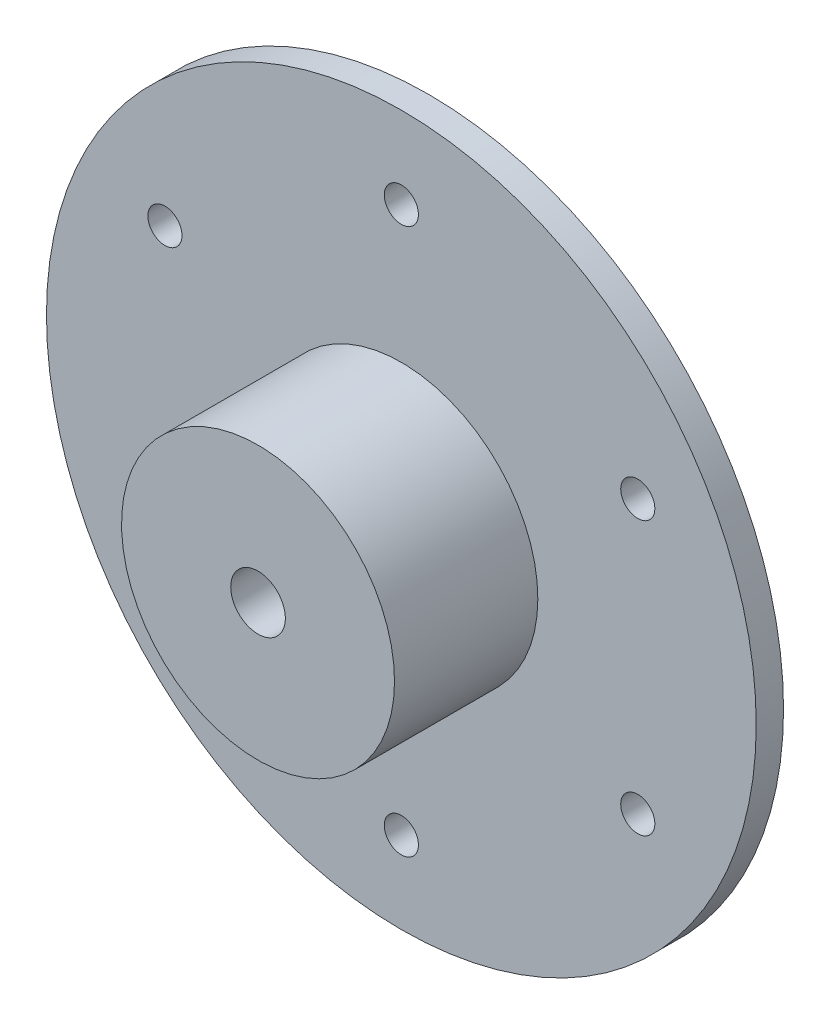
ISO-10303-21;
HEADER;
FILE_DESCRIPTION(('STEP AP214'),'2;1');
FILE_NAME('part.step','',(''),(''),'','','');
FILE_SCHEMA(('AUTOMOTIVE_DESIGN { 1 0 10303 214 1 1 1 1 }'));
ENDSEC;
DATA;
#1=APPLICATION_CONTEXT('core data for automotive mechanical design processes');
#2=APPLICATION_PROTOCOL_DEFINITION('international standard','automotive_design',2000,#1);
#3=PRODUCT_CONTEXT('',#1,'mechanical');
#4=PRODUCT('Part','Part','',(#3));
#5=PRODUCT_RELATED_PRODUCT_CATEGORY('part','',(#4));
#6=PRODUCT_DEFINITION_FORMATION('','',#4);
#7=PRODUCT_DEFINITION_CONTEXT('part definition',#1,'design');
#8=PRODUCT_DEFINITION('design','',#6,#7);
#9=PRODUCT_DEFINITION_SHAPE('','',#8);
#10=(LENGTH_UNIT() NAMED_UNIT(*) SI_UNIT(.MILLI.,.METRE.));
#11=(NAMED_UNIT(*) PLANE_ANGLE_UNIT() SI_UNIT($,.RADIAN.));
#12=(NAMED_UNIT(*) SI_UNIT($,.STERADIAN.) SOLID_ANGLE_UNIT());
#13=UNCERTAINTY_MEASURE_WITH_UNIT(LENGTH_MEASURE(1.E-05),#10,'distance_accuracy_value','');
#14=(GEOMETRIC_REPRESENTATION_CONTEXT(3) GLOBAL_UNCERTAINTY_ASSIGNED_CONTEXT((#13)) GLOBAL_UNIT_ASSIGNED_CONTEXT((#10,
#11,#12)) REPRESENTATION_CONTEXT('',''));
#15=CARTESIAN_POINT('',(0.,0.,0.));
#16=DIRECTION('',(0.,0.,1.));
#17=DIRECTION('',(1.,0.,0.));
#18=AXIS2_PLACEMENT_3D('',#15,#16,#17);
#19=CARTESIAN_POINT('',(0.,0.,0.));
#20=DIRECTION('',(0.,0.,1.));
#21=DIRECTION('',(0.,-1.,0.));
#22=AXIS2_PLACEMENT_3D('',#19,#20,#21);
#23=PLANE('',#22);
#24=CARTESIAN_POINT('',(0.,40.,0.));
#25=DIRECTION('',(0.,0.,1.));
#26=DIRECTION('',(0.,-1.,0.));
#27=AXIS2_PLACEMENT_3D('',#24,#25,#26);
#28=CIRCLE('',#27,2.5);
#29=CARTESIAN_POINT('',(0.,37.5,0.));
#30=VERTEX_POINT('',#29);
#31=EDGE_CURVE('E121',#30,#30,#28,.F.);
#32=ORIENTED_EDGE('',*,*,#31,.T.);
#33=EDGE_LOOP('',(#32));
#34=FACE_BOUND('',#33,.T.);
#35=CARTESIAN_POINT('',(34.6410161513767,19.9999999999985,0.));
#36=DIRECTION('',(0.,0.,1.));
#37=DIRECTION('',(0.,-1.,0.));
#38=AXIS2_PLACEMENT_3D('',#35,#36,#37);
#39=CIRCLE('',#38,2.50000000000173);
#40=CARTESIAN_POINT('',(34.6410161513767,17.4999999999968,0.));
#41=VERTEX_POINT('',#40);
#42=EDGE_CURVE('E64',#41,#41,#39,.F.);
#43=ORIENTED_EDGE('',*,*,#42,.T.);
#44=EDGE_LOOP('',(#43));
#45=FACE_BOUND('',#44,.T.);
#46=CARTESIAN_POINT('',(34.641016151375,-20.0000000000015,0.));
#47=DIRECTION('',(0.,0.,1.));
#48=DIRECTION('',(0.,-1.,0.));
#49=AXIS2_PLACEMENT_3D('',#46,#47,#48);
#50=CIRCLE('',#49,2.50000000000323);
#51=CARTESIAN_POINT('',(34.641016151375,-22.5000000000047,0.));
#52=VERTEX_POINT('',#51);
#53=EDGE_CURVE('E124',#52,#52,#50,.F.);
#54=ORIENTED_EDGE('',*,*,#53,.T.);
#55=EDGE_LOOP('',(#54));
#56=FACE_BOUND('',#55,.T.);
#57=CARTESIAN_POINT('',(-3.39590937005871E-12,-40.,0.));
#58=DIRECTION('',(0.,0.,1.));
#59=DIRECTION('',(0.,-1.,0.));
#60=AXIS2_PLACEMENT_3D('',#57,#58,#59);
#61=CIRCLE('',#60,2.50000000000352);
#62=CARTESIAN_POINT('',(-3.39590937005871E-12,-42.5000000000035,0.));
#63=VERTEX_POINT('',#62);
#64=EDGE_CURVE('E131',#63,#63,#61,.F.);
#65=ORIENTED_EDGE('',*,*,#64,.T.);
#66=EDGE_LOOP('',(#65));
#67=FACE_BOUND('',#66,.T.);
#68=CARTESIAN_POINT('',(-34.6410161513801,-19.9999999999985,0.));
#69=DIRECTION('',(0.,0.,1.));
#70=DIRECTION('',(0.,-1.,0.));
#71=AXIS2_PLACEMENT_3D('',#68,#69,#70);
#72=CIRCLE('',#71,2.50000000000219);
#73=CARTESIAN_POINT('',(-34.6410161513801,-22.5000000000007,0.));
#74=VERTEX_POINT('',#73);
#75=EDGE_CURVE('E137',#74,#74,#72,.F.);
#76=ORIENTED_EDGE('',*,*,#75,.T.);
#77=EDGE_LOOP('',(#76));
#78=FACE_BOUND('',#77,.T.);
#79=CARTESIAN_POINT('',(-34.6410161513784,20.0000000000015,0.));
#80=DIRECTION('',(0.,0.,1.));
#81=DIRECTION('',(0.,-1.,0.));
#82=AXIS2_PLACEMENT_3D('',#79,#80,#81);
#83=CIRCLE('',#82,2.50000000000049);
#84=CARTESIAN_POINT('',(-34.6410161513784,17.500000000001,0.));
#85=VERTEX_POINT('',#84);
#86=EDGE_CURVE('E143',#85,#85,#83,.F.);
#87=ORIENTED_EDGE('',*,*,#86,.T.);
#88=EDGE_LOOP('',(#87));
#89=FACE_BOUND('',#88,.T.);
#90=CARTESIAN_POINT('',(0.,0.,0.));
#91=DIRECTION('',(0.,0.,1.));
#92=DIRECTION('',(1.,0.,0.));
#93=AXIS2_PLACEMENT_3D('',#90,#91,#92);
#94=CIRCLE('',#93,20.);
#95=CARTESIAN_POINT('',(-12.,-16.,0.));
#96=VERTEX_POINT('',#95);
#97=CARTESIAN_POINT('',(-8.,-18.3303027798234,0.));
#98=VERTEX_POINT('',#97);
#99=EDGE_CURVE('E48',#96,#98,#94,.T.);
#100=ORIENTED_EDGE('',*,*,#99,.F.);
#101=EDGE_CURVE('E67',#98,#96,#94,.T.);
#102=ORIENTED_EDGE('',*,*,#101,.F.);
#103=EDGE_LOOP('',(#100,#102));
#104=FACE_BOUND('',#103,.T.);
#105=CARTESIAN_POINT('',(0.,0.,0.));
#106=DIRECTION('',(0.,0.,-1.));
#107=DIRECTION('',(0.,1.,0.));
#108=AXIS2_PLACEMENT_3D('',#105,#106,#107);
#109=CIRCLE('',#108,52.);
#110=CARTESIAN_POINT('',(0.,52.,0.));
#111=VERTEX_POINT('',#110);
#112=EDGE_CURVE('E70',#111,#111,#109,.T.);
#113=ORIENTED_EDGE('',*,*,#112,.F.);
#114=EDGE_LOOP('',(#113));
#115=FACE_BOUND('',#114,.T.);
#116=ADVANCED_FACE('F35',(#34,#45,#56,#67,#78,#89,#104,#115),#23,.T.);
#117=CARTESIAN_POINT('',(0.,0.,-25.));
#118=DIRECTION('',(0.,0.,-1.));
#119=DIRECTION('',(0.,1.,0.));
#120=AXIS2_PLACEMENT_3D('',#117,#118,#119);
#121=CYLINDRICAL_SURFACE('',#120,52.);
#122=ORIENTED_EDGE('',*,*,#112,.T.);
#123=EDGE_LOOP('',(#122));
#124=FACE_BOUND('',#123,.T.);
#125=CARTESIAN_POINT('',(0.,0.,-4.));
#126=DIRECTION('',(0.,0.,-1.));
#127=DIRECTION('',(0.,1.,0.));
#128=AXIS2_PLACEMENT_3D('',#125,#126,#127);
#129=CIRCLE('',#128,52.);
#130=CARTESIAN_POINT('',(0.,52.,-4.));
#131=VERTEX_POINT('',#130);
#132=EDGE_CURVE('E83',#131,#131,#129,.T.);
#133=ORIENTED_EDGE('',*,*,#132,.F.);
#134=EDGE_LOOP('',(#133));
#135=FACE_BOUND('',#134,.T.);
#136=ADVANCED_FACE('F88',(#124,#135),#121,.T.);
#137=CARTESIAN_POINT('',(0.,52.,-4.));
#138=DIRECTION('',(0.,0.,-1.));
#139=DIRECTION('',(0.,1.,0.));
#140=AXIS2_PLACEMENT_3D('',#137,#138,#139);
#141=PLANE('',#140);
#142=CARTESIAN_POINT('',(0.,40.,-4.));
#143=DIRECTION('',(0.,0.,-1.));
#144=DIRECTION('',(0.,1.,0.));
#145=AXIS2_PLACEMENT_3D('',#142,#143,#144);
#146=CIRCLE('',#145,2.5);
#147=CARTESIAN_POINT('',(0.,42.5,-4.));
#148=VERTEX_POINT('',#147);
#149=EDGE_CURVE('E117',#148,#148,#146,.T.);
#150=ORIENTED_EDGE('',*,*,#149,.F.);
#151=EDGE_LOOP('',(#150));
#152=FACE_BOUND('',#151,.T.);
#153=CARTESIAN_POINT('',(34.6410161513767,19.9999999999985,-4.));
#154=DIRECTION('',(0.,0.,-1.));
#155=DIRECTION('',(0.,1.,0.));
#156=AXIS2_PLACEMENT_3D('',#153,#154,#155);
#157=CIRCLE('',#156,2.50000000000173);
#158=CARTESIAN_POINT('',(34.6410161513767,22.5000000000002,-4.));
#159=VERTEX_POINT('',#158);
#160=EDGE_CURVE('E128',#159,#159,#157,.T.);
#161=ORIENTED_EDGE('',*,*,#160,.F.);
#162=EDGE_LOOP('',(#161));
#163=FACE_BOUND('',#162,.T.);
#164=CARTESIAN_POINT('',(34.641016151375,-20.0000000000015,-4.));
#165=DIRECTION('',(0.,0.,-1.));
#166=DIRECTION('',(0.,1.,0.));
#167=AXIS2_PLACEMENT_3D('',#164,#165,#166);
#168=CIRCLE('',#167,2.50000000000323);
#169=CARTESIAN_POINT('',(34.641016151375,-17.4999999999983,-4.));
#170=VERTEX_POINT('',#169);
#171=EDGE_CURVE('E127',#170,#170,#168,.T.);
#172=ORIENTED_EDGE('',*,*,#171,.F.);
#173=EDGE_LOOP('',(#172));
#174=FACE_BOUND('',#173,.T.);
#175=CARTESIAN_POINT('',(-3.39590937005871E-12,-40.,-4.));
#176=DIRECTION('',(0.,0.,-1.));
#177=DIRECTION('',(0.,1.,0.));
#178=AXIS2_PLACEMENT_3D('',#175,#176,#177);
#179=CIRCLE('',#178,2.50000000000352);
#180=CARTESIAN_POINT('',(-3.39590937005871E-12,-37.4999999999965,-4.));
#181=VERTEX_POINT('',#180);
#182=EDGE_CURVE('E134',#181,#181,#179,.T.);
#183=ORIENTED_EDGE('',*,*,#182,.F.);
#184=EDGE_LOOP('',(#183));
#185=FACE_BOUND('',#184,.T.);
#186=CARTESIAN_POINT('',(-34.6410161513801,-19.9999999999985,-4.));
#187=DIRECTION('',(0.,0.,-1.));
#188=DIRECTION('',(0.,1.,0.));
#189=AXIS2_PLACEMENT_3D('',#186,#187,#188);
#190=CIRCLE('',#189,2.50000000000219);
#191=CARTESIAN_POINT('',(-34.6410161513801,-17.4999999999963,-4.));
#192=VERTEX_POINT('',#191);
#193=EDGE_CURVE('E140',#192,#192,#190,.T.);
#194=ORIENTED_EDGE('',*,*,#193,.F.);
#195=EDGE_LOOP('',(#194));
#196=FACE_BOUND('',#195,.T.);
#197=CARTESIAN_POINT('',(-34.6410161513784,20.0000000000015,-4.));
#198=DIRECTION('',(0.,0.,-1.));
#199=DIRECTION('',(0.,1.,0.));
#200=AXIS2_PLACEMENT_3D('',#197,#198,#199);
#201=CIRCLE('',#200,2.50000000000049);
#202=CARTESIAN_POINT('',(-34.6410161513784,22.500000000002,-4.));
#203=VERTEX_POINT('',#202);
#204=EDGE_CURVE('E146',#203,#203,#201,.T.);
#205=ORIENTED_EDGE('',*,*,#204,.F.);
#206=EDGE_LOOP('',(#205));
#207=FACE_BOUND('',#206,.T.);
#208=ORIENTED_EDGE('',*,*,#132,.T.);
#209=EDGE_LOOP('',(#208));
#210=FACE_BOUND('',#209,.T.);
#211=CARTESIAN_POINT('',(0.,0.,-4.));
#212=DIRECTION('',(0.,0.,-1.));
#213=DIRECTION('',(0.,1.,0.));
#214=AXIS2_PLACEMENT_3D('',#211,#212,#213);
#215=CIRCLE('',#214,20.);
#216=CARTESIAN_POINT('',(0.,20.,-4.));
#217=VERTEX_POINT('',#216);
#218=EDGE_CURVE('E80',#217,#217,#215,.T.);
#219=ORIENTED_EDGE('',*,*,#218,.F.);
#220=EDGE_LOOP('',(#219));
#221=FACE_BOUND('',#220,.T.);
#222=ADVANCED_FACE('F96',(#152,#163,#174,#185,#196,#207,#210,#221),#141,.T.);
#223=CARTESIAN_POINT('',(0.,0.,-25.));
#224=DIRECTION('',(0.,0.,-1.));
#225=DIRECTION('',(0.,1.,0.));
#226=AXIS2_PLACEMENT_3D('',#223,#224,#225);
#227=CYLINDRICAL_SURFACE('',#226,20.);
#228=ORIENTED_EDGE('',*,*,#218,.T.);
#229=EDGE_LOOP('',(#228));
#230=FACE_BOUND('',#229,.T.);
#231=CARTESIAN_POINT('',(0.,0.,-25.));
#232=DIRECTION('',(0.,0.,-1.));
#233=DIRECTION('',(0.,1.,0.));
#234=AXIS2_PLACEMENT_3D('',#231,#232,#233);
#235=CIRCLE('',#234,20.);
#236=CARTESIAN_POINT('',(0.,20.,-25.));
#237=VERTEX_POINT('',#236);
#238=EDGE_CURVE('E77',#237,#237,#235,.T.);
#239=ORIENTED_EDGE('',*,*,#238,.F.);
#240=EDGE_LOOP('',(#239));
#241=FACE_BOUND('',#240,.T.);
#242=ADVANCED_FACE('F206',(#230,#241),#227,.T.);
#243=CARTESIAN_POINT('',(0.,20.,-25.));
#244=DIRECTION('',(0.,0.,-1.));
#245=DIRECTION('',(0.,1.,0.));
#246=AXIS2_PLACEMENT_3D('',#243,#244,#245);
#247=PLANE('',#246);
#248=ORIENTED_EDGE('',*,*,#238,.T.);
#249=EDGE_LOOP('',(#248));
#250=FACE_BOUND('',#249,.T.);
#251=ADVANCED_FACE('F198',(#250),#247,.T.);
#252=CARTESIAN_POINT('',(0.,0.,21.));
#253=DIRECTION('',(0.,0.,1.));
#254=DIRECTION('',(1.,0.,0.));
#255=AXIS2_PLACEMENT_3D('',#252,#253,#254);
#256=PLANE('',#255);
#257=CARTESIAN_POINT('',(0.,0.,21.));
#258=DIRECTION('',(0.,0.,1.));
#259=DIRECTION('',(1.,0.,0.));
#260=AXIS2_PLACEMENT_3D('',#257,#258,#259);
#261=CIRCLE('',#260,20.);
#262=CARTESIAN_POINT('',(20.,0.,21.));
#263=VERTEX_POINT('',#262);
#264=EDGE_CURVE('E75',#263,#263,#261,.T.);
#265=ORIENTED_EDGE('',*,*,#264,.T.);
#266=EDGE_LOOP('',(#265));
#267=FACE_BOUND('',#266,.T.);
#268=CARTESIAN_POINT('',(0.,0.,21.));
#269=DIRECTION('',(0.,0.,1.));
#270=DIRECTION('',(1.,0.,0.));
#271=AXIS2_PLACEMENT_3D('',#268,#269,#270);
#272=CIRCLE('',#271,4.);
#273=CARTESIAN_POINT('',(-4.,0.,21.));
#274=VERTEX_POINT('',#273);
#275=EDGE_CURVE('E116',#274,#274,#272,.T.);
#276=ORIENTED_EDGE('',*,*,#275,.F.);
#277=EDGE_LOOP('',(#276));
#278=FACE_BOUND('',#277,.T.);
#279=ADVANCED_FACE('F196',(#267,#278),#256,.T.);
#280=CARTESIAN_POINT('',(0.,0.,21.));
#281=DIRECTION('',(0.,0.,-1.));
#282=DIRECTION('',(-1.,0.,0.));
#283=AXIS2_PLACEMENT_3D('',#280,#281,#282);
#284=CYLINDRICAL_SURFACE('',#283,20.);
#285=ORIENTED_EDGE('',*,*,#264,.F.);
#286=EDGE_LOOP('',(#285));
#287=FACE_BOUND('',#286,.T.);
#288=ORIENTED_EDGE('',*,*,#101,.T.);
#289=CARTESIAN_POINT('',(-12.,-16.,0.));
#290=CARTESIAN_POINT('',(-12.0000101233234,-15.9999905067964,0.0487289718639568));
#291=CARTESIAN_POINT('',(-11.9982194438858,-16.0013353756541,0.097450713025799));
#292=CARTESIAN_POINT('',(-11.9911145309738,-16.0066613666104,0.194464428904642));
#293=CARTESIAN_POINT('',(-11.9858023142477,-16.0106409798161,0.242756633580225));
#294=CARTESIAN_POINT('',(-11.9717768126505,-16.0211307857119,0.338248979095475));
#295=CARTESIAN_POINT('',(-11.963085301947,-16.0276247761518,0.385454102190797));
#296=CARTESIAN_POINT('',(-11.9424454984849,-16.0430097226239,0.478738681584226));
#297=CARTESIAN_POINT('',(-11.9304968949507,-16.0519009073836,0.524818030009157));
#298=CARTESIAN_POINT('',(-11.8900660509872,-16.0818985557425,0.66071798323746));
#299=CARTESIAN_POINT('',(-11.8569564733228,-16.1063611012686,0.748479747940397));
#300=CARTESIAN_POINT('',(-11.7800015392058,-16.1627296184782,0.916613796394762));
#301=CARTESIAN_POINT('',(-11.7361401552755,-16.1946466990864,0.996974799679511));
#302=CARTESIAN_POINT('',(-11.6354195943724,-16.2671803688255,1.15538146984181));
#303=CARTESIAN_POINT('',(-11.5777947783427,-16.3082925648958,1.23271080241722));
#304=CARTESIAN_POINT('',(-11.4538402969607,-16.3955877215706,1.37673143332689));
#305=CARTESIAN_POINT('',(-11.3875078786644,-16.4417722850673,1.44341935249979));
#306=CARTESIAN_POINT('',(-11.2342462574898,-16.5469605966923,1.57762741136849));
#307=CARTESIAN_POINT('',(-11.1458102195658,-16.6067205957566,1.64283647233636));
#308=CARTESIAN_POINT('',(-10.9610550329551,-16.7292435982712,1.75732805708111));
#309=CARTESIAN_POINT('',(-10.8647304811991,-16.7920086475358,1.80659954847518));
#310=CARTESIAN_POINT('',(-10.6506234805048,-16.9287545396277,1.89528936197222));
#311=CARTESIAN_POINT('',(-10.5318388165396,-17.0029565620872,1.93196840354252));
#312=CARTESIAN_POINT('',(-10.2892015250984,-17.1508760063772,1.98286144798013));
#313=CARTESIAN_POINT('',(-10.1653464209962,-17.224593170477,1.99706433489478));
#314=CARTESIAN_POINT('',(-9.90905172292154,-17.3733633194739,2.00224900771416));
#315=CARTESIAN_POINT('',(-9.77650366647577,-17.4482820277842,1.99196782505431));
#316=CARTESIAN_POINT('',(-9.51342703226995,-17.5931017012986,1.94450287864027));
#317=CARTESIAN_POINT('',(-9.38289792759556,-17.6630039936524,1.9073262594347));
#318=CARTESIAN_POINT('',(-9.13675784878247,-17.7915080384409,1.80867310259087));
#319=CARTESIAN_POINT('',(-9.02072290550471,-17.8505399039259,1.74882649427328));
#320=CARTESIAN_POINT('',(-8.79997497316689,-17.9603903712057,1.60537122627947));
#321=CARTESIAN_POINT('',(-8.69525147462399,-18.0112166189611,1.52178488996539));
#322=CARTESIAN_POINT('',(-8.51403151750714,-18.0975181252364,1.34390005547879));
#323=CARTESIAN_POINT('',(-8.43566039082885,-18.1340990694228,1.25204754077087));
#324=CARTESIAN_POINT('',(-8.29570336115818,-18.1985510816066,1.05360141571232));
#325=CARTESIAN_POINT('',(-8.23410998026349,-18.2264260307124,0.947014404618786));
#326=CARTESIAN_POINT('',(-8.13655998524603,-18.2701655620184,0.734690401888865));
#327=CARTESIAN_POINT('',(-8.09856599172421,-18.286995835569,0.630081764826859));
#328=CARTESIAN_POINT('',(-8.04042242947589,-18.3126360292912,0.415188442490053));
#329=CARTESIAN_POINT('',(-8.02023502231851,-18.3214629574385,0.304916322551931));
#330=CARTESIAN_POINT('',(-8.00626922384583,-18.3275654323848,0.161537371280846));
#331=CARTESIAN_POINT('',(-8.00391763150382,-18.3285924883313,0.129256924480953));
#332=CARTESIAN_POINT('',(-8.00078540234506,-18.3299601400733,0.0646558643795152));
#333=CARTESIAN_POINT('',(-8.00000231950716,-18.3303018047074,0.0323353923903304));
#334=CARTESIAN_POINT('',(-7.99999999999999,-18.3303027798234,0.));
#335=B_SPLINE_CURVE_WITH_KNOTS('',3,(#289,#290,#291,#292,#293,#294,#295,#296,#297,#298,#299,
#300,#301,#302,#303,#304,#305,#306,#307,#308,#309,#310,#311,#312,#313,#314,#315,#316,#317,#318,
#319,#320,#321,#322,#323,#324,#325,#326,#327,#328,#329,#330,#331,#332,#333,#334),.UNSPECIFIED.,
.F.,.F.,(4,2,2,2,2,2,2,2,2,2,2,2,2,2,2,2,2,2,2,2,2,2,4),(0.,0.146123611782879,0.292163612281279,
0.437277808953796,0.582405856547037,0.871820266945697,1.16166875286998,1.475024127086,
1.78847880955653,2.16227448961918,2.53632836936687,2.96878083462014,3.40144710960004,
3.85691088892291,4.31225372249332,4.73967384577057,5.16669337297488,5.54307119478227,
5.91928098811634,6.25525360695086,6.59051056266781,6.68762721671905,6.7845923033659),.UNSPECIFIED.);
#336=EDGE_CURVE('E11',#96,#98,#335,.T.);
#337=ORIENTED_EDGE('',*,*,#336,.T.);
#338=EDGE_LOOP('',(#288,#337));
#339=FACE_BOUND('',#338,.T.);
#340=ADVANCED_FACE('F68',(#287,#339),#284,.T.);
#341=CARTESIAN_POINT('',(0.,0.,21.));
#342=DIRECTION('',(0.,0.,-1.));
#343=DIRECTION('',(-1.,0.,0.));
#344=AXIS2_PLACEMENT_3D('',#341,#342,#343);
#345=CYLINDRICAL_SURFACE('',#344,4.);
#346=CARTESIAN_POINT('',(0.,0.,0.));
#347=DIRECTION('',(0.,0.,1.));
#348=DIRECTION('',(1.,0.,0.));
#349=AXIS2_PLACEMENT_3D('',#346,#347,#348);
#350=CIRCLE('',#349,4.);
#351=CARTESIAN_POINT('',(-4.,0.,0.));
#352=VERTEX_POINT('',#351);
#353=EDGE_CURVE('E114',#352,#352,#350,.T.);
#354=CARTESIAN_POINT('',(-4.,0.,21.));
#355=CARTESIAN_POINT('',(-4.,0.,20.78125));
#356=CARTESIAN_POINT('',(-4.,0.,20.5625));
#357=CARTESIAN_POINT('',(-4.,0.,20.125));
#358=CARTESIAN_POINT('',(-4.,0.,19.90625));
#359=CARTESIAN_POINT('',(-4.,0.,19.46875));
#360=CARTESIAN_POINT('',(-4.,0.,19.25));
#361=CARTESIAN_POINT('',(-4.,0.,18.8125));
#362=CARTESIAN_POINT('',(-4.,0.,18.59375));
#363=CARTESIAN_POINT('',(-4.,0.,18.15625));
#364=CARTESIAN_POINT('',(-4.,0.,17.9375));
#365=CARTESIAN_POINT('',(-4.,0.,17.5));
#366=CARTESIAN_POINT('',(-4.,0.,17.28125));
#367=CARTESIAN_POINT('',(-4.,0.,16.84375));
#368=CARTESIAN_POINT('',(-4.,0.,16.625));
#369=CARTESIAN_POINT('',(-4.,0.,16.1875));
#370=CARTESIAN_POINT('',(-4.,0.,15.96875));
#371=CARTESIAN_POINT('',(-4.,0.,15.53125));
#372=CARTESIAN_POINT('',(-4.,0.,15.3125));
#373=CARTESIAN_POINT('',(-4.,0.,14.875));
#374=CARTESIAN_POINT('',(-4.,0.,14.65625));
#375=CARTESIAN_POINT('',(-4.,0.,14.21875));
#376=CARTESIAN_POINT('',(-4.,0.,14.));
#377=CARTESIAN_POINT('',(-4.,0.,13.5625));
#378=CARTESIAN_POINT('',(-4.,0.,13.34375));
#379=CARTESIAN_POINT('',(-4.,0.,12.90625));
#380=CARTESIAN_POINT('',(-4.,0.,12.6875));
#381=CARTESIAN_POINT('',(-4.,0.,12.25));
#382=CARTESIAN_POINT('',(-4.,0.,12.03125));
#383=CARTESIAN_POINT('',(-4.,0.,11.59375));
#384=CARTESIAN_POINT('',(-4.,0.,11.375));
#385=CARTESIAN_POINT('',(-4.,0.,10.9375));
#386=CARTESIAN_POINT('',(-4.,0.,10.71875));
#387=CARTESIAN_POINT('',(-4.,0.,10.28125));
#388=CARTESIAN_POINT('',(-4.,0.,10.0625));
#389=CARTESIAN_POINT('',(-4.,0.,9.625));
#390=CARTESIAN_POINT('',(-4.,0.,9.40625));
#391=CARTESIAN_POINT('',(-4.,0.,8.96875));
#392=CARTESIAN_POINT('',(-4.,0.,8.75));
#393=CARTESIAN_POINT('',(-4.,0.,8.3125));
#394=CARTESIAN_POINT('',(-4.,0.,8.09375));
#395=CARTESIAN_POINT('',(-4.,0.,7.65625));
#396=CARTESIAN_POINT('',(-4.,0.,7.4375));
#397=CARTESIAN_POINT('',(-4.,0.,7.));
#398=CARTESIAN_POINT('',(-4.,0.,6.78125));
#399=CARTESIAN_POINT('',(-4.,0.,6.34375));
#400=CARTESIAN_POINT('',(-4.,0.,6.125));
#401=CARTESIAN_POINT('',(-4.,0.,5.6875));
#402=CARTESIAN_POINT('',(-4.,0.,5.46875));
#403=CARTESIAN_POINT('',(-4.,0.,5.03125));
#404=CARTESIAN_POINT('',(-4.,0.,4.8125));
#405=CARTESIAN_POINT('',(-4.,0.,4.375));
#406=CARTESIAN_POINT('',(-4.,0.,4.15625));
#407=CARTESIAN_POINT('',(-4.,0.,3.71875));
#408=CARTESIAN_POINT('',(-4.,0.,3.5));
#409=CARTESIAN_POINT('',(-4.,0.,3.0625));
#410=CARTESIAN_POINT('',(-4.,0.,2.84375));
#411=CARTESIAN_POINT('',(-4.,0.,2.40625));
#412=CARTESIAN_POINT('',(-4.,0.,2.1875));
#413=CARTESIAN_POINT('',(-4.,0.,1.75));
#414=CARTESIAN_POINT('',(-4.,0.,1.53125));
#415=CARTESIAN_POINT('',(-4.,0.,1.09375));
#416=CARTESIAN_POINT('',(-4.,0.,0.875000000000001));
#417=CARTESIAN_POINT('',(-4.,0.,0.4375));
#418=CARTESIAN_POINT('',(-4.,0.,0.21875));
#419=CARTESIAN_POINT('',(-4.,0.,0.));
#420=B_SPLINE_CURVE_WITH_KNOTS('',3,(#354,#355,#356,#357,#358,#359,#360,#361,#362,#363,#364,
#365,#366,#367,#368,#369,#370,#371,#372,#373,#374,#375,#376,#377,#378,#379,#380,#381,#382,#383,
#384,#385,#386,#387,#388,#389,#390,#391,#392,#393,#394,#395,#396,#397,#398,#399,#400,#401,#402,
#403,#404,#405,#406,#407,#408,#409,#410,#411,#412,#413,#414,#415,#416,#417,#418,#419),
.UNSPECIFIED.,.F.,.F.,(4,2,2,2,2,2,2,2,2,2,2,2,2,2,2,2,2,2,2,2,2,2,2,2,2,2,2,2,2,2,2,2,4),(0.,
0.656249999999997,1.3125,1.96875,2.625,3.28125,3.9375,4.59375,5.25,5.90625,6.5625,7.21875,7.875,
8.53125,9.1875,9.84375,10.5,11.15625,11.8125,12.46875,13.125,13.78125,14.4375,15.09375,15.75,
16.40625,17.0625,17.71875,18.375,19.03125,19.6875,20.34375,21.),.UNSPECIFIED.);
#421=EDGE_CURVE('BSEAM101',#274,#352,#420,.T.);
#422=ORIENTED_EDGE('',*,*,#275,.T.);
#423=ORIENTED_EDGE('',*,*,#353,.F.);
#424=ORIENTED_EDGE('',*,*,#421,.T.);
#425=ORIENTED_EDGE('',*,*,#421,.F.);
#426=EDGE_LOOP('',(#422,#424,#423,#425));
#427=FACE_BOUND('',#426,.T.);
#428=ADVANCED_FACE('F101',(#427),#345,.F.);
#429=ORIENTED_EDGE('',*,*,#353,.T.);
#430=EDGE_LOOP('',(#429));
#431=FACE_BOUND('',#430,.T.);
#432=ADVANCED_FACE('F92',(#431),#23,.T.);
#433=CARTESIAN_POINT('',(-34.6410161513784,20.0000000000015,21.001));
#434=DIRECTION('',(0.,0.,-1.));
#435=DIRECTION('',(0.,1.,0.));
#436=AXIS2_PLACEMENT_3D('',#433,#434,#435);
#437=CYLINDRICAL_SURFACE('',#436,2.50000000000049);
#438=ORIENTED_EDGE('',*,*,#86,.F.);
#439=EDGE_LOOP('',(#438));
#440=FACE_BOUND('',#439,.T.);
#441=ORIENTED_EDGE('',*,*,#204,.T.);
#442=EDGE_LOOP('',(#441));
#443=FACE_BOUND('',#442,.T.);
#444=ADVANCED_FACE('F100',(#440,#443),#437,.F.);
#445=CARTESIAN_POINT('',(-34.6410161513801,-19.9999999999985,21.001));
#446=DIRECTION('',(0.,0.,-1.));
#447=DIRECTION('',(0.,1.,0.));
#448=AXIS2_PLACEMENT_3D('',#445,#446,#447);
#449=CYLINDRICAL_SURFACE('',#448,2.50000000000219);
#450=ORIENTED_EDGE('',*,*,#75,.F.);
#451=EDGE_LOOP('',(#450));
#452=FACE_BOUND('',#451,.T.);
#453=ORIENTED_EDGE('',*,*,#193,.T.);
#454=EDGE_LOOP('',(#453));
#455=FACE_BOUND('',#454,.T.);
#456=ADVANCED_FACE('F107',(#452,#455),#449,.F.);
#457=CARTESIAN_POINT('',(-3.39590937005871E-12,-40.,21.001));
#458=DIRECTION('',(0.,0.,-1.));
#459=DIRECTION('',(0.,1.,0.));
#460=AXIS2_PLACEMENT_3D('',#457,#458,#459);
#461=CYLINDRICAL_SURFACE('',#460,2.50000000000352);
#462=ORIENTED_EDGE('',*,*,#64,.F.);
#463=EDGE_LOOP('',(#462));
#464=FACE_BOUND('',#463,.T.);
#465=ORIENTED_EDGE('',*,*,#182,.T.);
#466=EDGE_LOOP('',(#465));
#467=FACE_BOUND('',#466,.T.);
#468=ADVANCED_FACE('F188',(#464,#467),#461,.F.);
#469=CARTESIAN_POINT('',(34.641016151375,-20.0000000000015,21.001));
#470=DIRECTION('',(0.,0.,-1.));
#471=DIRECTION('',(0.,1.,0.));
#472=AXIS2_PLACEMENT_3D('',#469,#470,#471);
#473=CYLINDRICAL_SURFACE('',#472,2.50000000000323);
#474=ORIENTED_EDGE('',*,*,#53,.F.);
#475=EDGE_LOOP('',(#474));
#476=FACE_BOUND('',#475,.T.);
#477=ORIENTED_EDGE('',*,*,#171,.T.);
#478=EDGE_LOOP('',(#477));
#479=FACE_BOUND('',#478,.T.);
#480=ADVANCED_FACE('F180',(#476,#479),#473,.F.);
#481=CARTESIAN_POINT('',(34.6410161513767,19.9999999999985,21.001));
#482=DIRECTION('',(0.,0.,-1.));
#483=DIRECTION('',(0.,1.,0.));
#484=AXIS2_PLACEMENT_3D('',#481,#482,#483);
#485=CYLINDRICAL_SURFACE('',#484,2.50000000000173);
#486=ORIENTED_EDGE('',*,*,#42,.F.);
#487=EDGE_LOOP('',(#486));
#488=FACE_BOUND('',#487,.T.);
#489=ORIENTED_EDGE('',*,*,#160,.T.);
#490=EDGE_LOOP('',(#489));
#491=FACE_BOUND('',#490,.T.);
#492=ADVANCED_FACE('F175',(#488,#491),#485,.F.);
#493=CARTESIAN_POINT('',(0.,40.,21.001));
#494=DIRECTION('',(0.,0.,-1.));
#495=DIRECTION('',(0.,1.,0.));
#496=AXIS2_PLACEMENT_3D('',#493,#494,#495);
#497=CYLINDRICAL_SURFACE('',#496,2.5);
#498=ORIENTED_EDGE('',*,*,#31,.F.);
#499=EDGE_LOOP('',(#498));
#500=FACE_BOUND('',#499,.T.);
#501=ORIENTED_EDGE('',*,*,#149,.T.);
#502=EDGE_LOOP('',(#501));
#503=FACE_BOUND('',#502,.T.);
#504=ADVANCED_FACE('F169',(#500,#503),#497,.F.);
#505=CARTESIAN_POINT('',(-10.,-52.001,0.));
#506=DIRECTION('',(0.,1.,0.));
#507=DIRECTION('',(0.,0.,1.));
#508=AXIS2_PLACEMENT_3D('',#505,#506,#507);
#509=CYLINDRICAL_SURFACE('',#508,2.);
#510=CARTESIAN_POINT('',(-10.,-17.3205080756888,2.));
#511=CARTESIAN_POINT('',(-10.1475925827179,-17.2352906091489,1.99999558149405));
#512=CARTESIAN_POINT('',(-10.2942508377655,-17.1480729674411,1.98364321010682));
#513=CARTESIAN_POINT('',(-10.5804869518536,-16.9729663299162,1.91953935076355));
#514=CARTESIAN_POINT('',(-10.7200470476665,-16.885076227649,1.87171289882221));
#515=CARTESIAN_POINT('',(-10.9721522586069,-16.7221966725732,1.7527497774216));
#516=CARTESIAN_POINT('',(-11.0859759001727,-16.6468591654274,1.68479505638804));
#517=CARTESIAN_POINT('',(-11.3001631721926,-16.5022098673345,1.52555392126083));
#518=CARTESIAN_POINT('',(-11.4005575726789,-16.4328844339944,1.43432228674944));
#519=CARTESIAN_POINT('',(-11.5596251721061,-16.3212117063223,1.2561406906193));
#520=CARTESIAN_POINT('',(-11.6223563204237,-16.2765390043468,1.17425667275575));
#521=CARTESIAN_POINT('',(-11.735774357866,-16.1949520492015,0.998980168102487));
#522=CARTESIAN_POINT('',(-11.7864664553294,-16.1580344418211,0.905592684599015));
#523=CARTESIAN_POINT('',(-11.8736032696072,-16.0941143437366,0.708064754195359));
#524=CARTESIAN_POINT('',(-11.9099187081777,-16.0672019480002,0.603836927766534));
#525=CARTESIAN_POINT('',(-11.9650456606052,-16.0261941996753,0.388459021829362));
#526=CARTESIAN_POINT('',(-11.9838791444632,-16.0120827603199,0.277317818571716));
#527=CARTESIAN_POINT('',(-12.0011152856925,-15.9991660529582,0.0692205133067167));
#528=CARTESIAN_POINT('',(-12.0021239966332,-15.9984084491518,-0.0274070552426649));
#529=CARTESIAN_POINT('',(-11.9902604093802,-16.0073018328845,-0.219304838600477));
#530=CARTESIAN_POINT('',(-11.9773909362785,-16.0169507020455,-0.314575325661908));
#531=CARTESIAN_POINT('',(-11.9397425338118,-16.045031936138,-0.495420997069087));
#532=CARTESIAN_POINT('',(-11.9156985713205,-16.0629217156785,-0.581237924961527));
#533=CARTESIAN_POINT('',(-11.8572445449421,-16.1061189226963,-0.747257556400085));
#534=CARTESIAN_POINT('',(-11.8228321683229,-16.131428005056,-0.827459002458166));
#535=CARTESIAN_POINT('',(-11.7412855767206,-16.1908920552144,-0.988341897426339));
#536=CARTESIAN_POINT('',(-11.693249304108,-16.2256616137085,-1.06833538083343));
#537=CARTESIAN_POINT('',(-11.5881306439359,-16.300902110695,-1.21914044414078));
#538=CARTESIAN_POINT('',(-11.531043271037,-16.341376189861,-1.28994692453394));
#539=CARTESIAN_POINT('',(-11.3984994882077,-16.4341670995694,-1.4336600169268));
#540=CARTESIAN_POINT('',(-11.3215830356808,-16.4873083978088,-1.50468662143188));
#541=CARTESIAN_POINT('',(-11.1594577437797,-16.5974736855261,-1.63289790637092));
#542=CARTESIAN_POINT('',(-11.0742435088513,-16.65450019399,-1.69007349490761));
#543=CARTESIAN_POINT('',(-10.8815489903665,-16.781162173048,-1.7992244659082));
#544=CARTESIAN_POINT('',(-10.7728034123262,-16.8512369906286,-1.84846857942307));
#545=CARTESIAN_POINT('',(-10.5488433129763,-16.9923352345074,-1.92687907979697));
#546=CARTESIAN_POINT('',(-10.4336249778635,-17.0633592008672,-1.95603349255478));
#547=CARTESIAN_POINT('',(-10.1880589079245,-17.2112132337541,-1.99537578336966));
#548=CARTESIAN_POINT('',(-10.0573158358716,-17.2879514949127,-2.00349111183369));
#549=CARTESIAN_POINT('',(-9.79477546032644,-17.4380397964332,-1.9937733298782));
#550=CARTESIAN_POINT('',(-9.66297808775693,-17.5113896126175,-1.97593850514085));
#551=CARTESIAN_POINT('',(-9.40587017066077,-17.6507923296519,-1.91417296080971));
#552=CARTESIAN_POINT('',(-9.28047982442263,-17.7169790956624,-1.87088590976472));
#553=CARTESIAN_POINT('',(-9.03783989900372,-17.8419742431368,-1.75843241577564));
#554=CARTESIAN_POINT('',(-8.9205842450971,-17.9007881574819,-1.68928553619382));
#555=CARTESIAN_POINT('',(-8.71170081664718,-18.0032879616925,-1.53470848624323));
#556=CARTESIAN_POINT('',(-8.61867354628769,-18.0479181863366,-1.45180014284651));
#557=CARTESIAN_POINT('',(-8.44808850763258,-18.1283949623684,-1.26777982877167));
#558=CARTESIAN_POINT('',(-8.37051713654389,-18.1642492439026,-1.16668401542878));
#559=CARTESIAN_POINT('',(-8.24302696402253,-18.222427177028,-0.962197850092407));
#560=CARTESIAN_POINT('',(-8.19092966819595,-18.2458458200541,-0.860473654766051));
#561=CARTESIAN_POINT('',(-8.10452223889104,-18.2843916166658,-0.648275314929103));
#562=CARTESIAN_POINT('',(-8.07020203963015,-18.2995234626964,-0.537806162947823));
#563=CARTESIAN_POINT('',(-8.02305222826739,-18.3202413063828,-0.320926731789771));
#564=CARTESIAN_POINT('',(-8.00871485117815,-18.3264977651502,-0.214905732580733));
#565=CARTESIAN_POINT('',(-7.99715788730398,-18.3315441618209,-0.00176780877141891));
#566=CARTESIAN_POINT('',(-7.99993392139595,-18.3303360098311,0.105348828464365));
#567=CARTESIAN_POINT('',(-8.02210538885178,-18.320642928367,0.313984193713671));
#568=CARTESIAN_POINT('',(-8.04096146862379,-18.3123941463657,0.415572007910619));
#569=CARTESIAN_POINT('',(-8.09378734744672,-18.289106924877,0.613910039115056));
#570=CARTESIAN_POINT('',(-8.12775705417539,-18.2740685268642,0.710660285669025));
#571=CARTESIAN_POINT('',(-8.20995773142268,-18.2372869065066,0.897962910439099));
#572=CARTESIAN_POINT('',(-8.25835781929449,-18.2154640358651,0.988425155829396));
#573=CARTESIAN_POINT('',(-8.36740721624032,-18.1656290895252,1.15972251284947));
#574=CARTESIAN_POINT('',(-8.42805818773252,-18.1376161738028,1.2405563155515));
#575=CARTESIAN_POINT('',(-8.56294915113498,-18.0743387926598,1.39496838469444));
#576=CARTESIAN_POINT('',(-8.63773456302498,-18.0387713294151,1.46794475359537));
#577=CARTESIAN_POINT('',(-8.79599700835022,-17.9621314856184,1.60032289507366));
#578=CARTESIAN_POINT('',(-8.8794785457668,-17.9210562492322,1.6597175819016));
#579=CARTESIAN_POINT('',(-9.06026278984797,-17.8303877910857,1.76889926207753));
#580=CARTESIAN_POINT('',(-9.15813528120619,-17.7803630774229,1.81738089099983));
#581=CARTESIAN_POINT('',(-9.35824402700151,-17.675859187885,1.89730208938014));
#582=CARTESIAN_POINT('',(-9.46047809636188,-17.6213822302689,1.9287500867131));
#583=CARTESIAN_POINT('',(-9.63592678397966,-17.5258585269328,1.96798041642207));
#584=CARTESIAN_POINT('',(-9.70868705831241,-17.4856612741051,1.98002598513995));
#585=CARTESIAN_POINT('',(-9.85437376023012,-17.4039740266534,1.99603791702561));
#586=CARTESIAN_POINT('',(-9.92730022613376,-17.3624836982629,2.00000217642633));
#587=CARTESIAN_POINT('',(-10.,-17.3205080756888,2.));
#588=B_SPLINE_CURVE_WITH_KNOTS('',3,(#510,#511,#512,#513,#514,#515,#516,#517,#518,#519,#520,
#521,#522,#523,#524,#525,#526,#527,#528,#529,#530,#531,#532,#533,#534,#535,#536,#537,#538,#539,
#540,#541,#542,#543,#544,#545,#546,#547,#548,#549,#550,#551,#552,#553,#554,#555,#556,#557,#558,
#559,#560,#561,#562,#563,#564,#565,#566,#567,#568,#569,#570,#571,#572,#573,#574,#575,#576,#577,
#578,#579,#580,#581,#582,#583,#584,#585,#586,#587),.UNSPECIFIED.,.T.,.F.,(4,2,2,2,2,2,2,2,2,2,2,
2,2,2,2,2,2,2,2,2,2,2,2,2,2,2,2,2,2,2,2,2,2,2,2,2,2,2,4),(0.,0.51090260724279,1.0230264919771,
1.47822547826814,1.93236293049399,2.26829928804661,2.60409004686285,2.94283522534651,
3.28115411580301,3.56951972544935,3.85782664545694,4.12939185625724,4.40101768607746,
4.69862673709901,4.99640028411831,5.34731133963825,5.69845211510318,6.11201457386421,
6.52582331629981,6.97907234881921,7.43235132521481,7.87463231626153,8.31657938947848,
8.71141100942718,9.10589358661568,9.45401243500335,9.8019339547857,10.1218439524246,
10.4416720922103,10.7511764317146,11.0606788806238,11.3739615449549,11.6872867496544,
12.0170253577803,12.3469356045449,12.7058768831651,13.0646404027451,13.3162305433678,
13.5678861708407),.UNSPECIFIED.);
#589=EDGE_CURVE('E54',#96,#98,#588,.T.);
#590=ORIENTED_EDGE('',*,*,#589,.T.);
#591=ORIENTED_EDGE('',*,*,#336,.F.);
#592=EDGE_LOOP('',(#590,#591));
#593=FACE_BOUND('',#592,.T.);
#594=CARTESIAN_POINT('',(-10.,0.,0.));
#595=DIRECTION('',(0.,1.,0.));
#596=DIRECTION('',(0.,0.,1.));
#597=AXIS2_PLACEMENT_3D('',#594,#595,#596);
#598=CIRCLE('',#597,2.);
#599=CARTESIAN_POINT('',(-10.,0.,2.));
#600=VERTEX_POINT('',#599);
#601=EDGE_CURVE('E65',#600,#600,#598,.T.);
#602=ORIENTED_EDGE('',*,*,#601,.T.);
#603=EDGE_LOOP('',(#602));
#604=FACE_BOUND('',#603,.T.);
#605=ADVANCED_FACE('F56',(#593,#604),#509,.F.);
#606=CARTESIAN_POINT('',(-10.,0.,0.));
#607=DIRECTION('',(0.,1.,0.));
#608=DIRECTION('',(0.,0.,1.));
#609=AXIS2_PLACEMENT_3D('',#606,#607,#608);
#610=PLANE('',#609);
#611=ORIENTED_EDGE('',*,*,#601,.F.);
#612=EDGE_LOOP('',(#611));
#613=FACE_BOUND('',#612,.T.);
#614=ADVANCED_FACE('F163',(#613),#610,.F.);
#615=CARTESIAN_POINT('',(0.,0.,21.));
#616=DIRECTION('',(0.,0.,-1.));
#617=DIRECTION('',(-1.,0.,0.));
#618=AXIS2_PLACEMENT_3D('',#615,#616,#617);
#619=CYLINDRICAL_SURFACE('',#618,20.);
#620=ORIENTED_EDGE('',*,*,#589,.F.);
#621=ORIENTED_EDGE('',*,*,#99,.T.);
#622=EDGE_LOOP('',(#620,#621));
#623=FACE_BOUND('',#622,.T.);
#624=ADVANCED_FACE('F62',(#623),#619,.F.);
#625=CLOSED_SHELL('',(#116,#136,#222,#242,#251,#279,#340,#428,#432,#444,#456,#468,#480,#492,
#504,#605,#614,#624));
#626=MANIFOLD_SOLID_BREP('B2',#625);
#627=ADVANCED_BREP_SHAPE_REPRESENTATION('',(#18,#626),#14);
#628=SHAPE_DEFINITION_REPRESENTATION(#9,#627);
ENDSEC;
END-ISO-10303-21;
